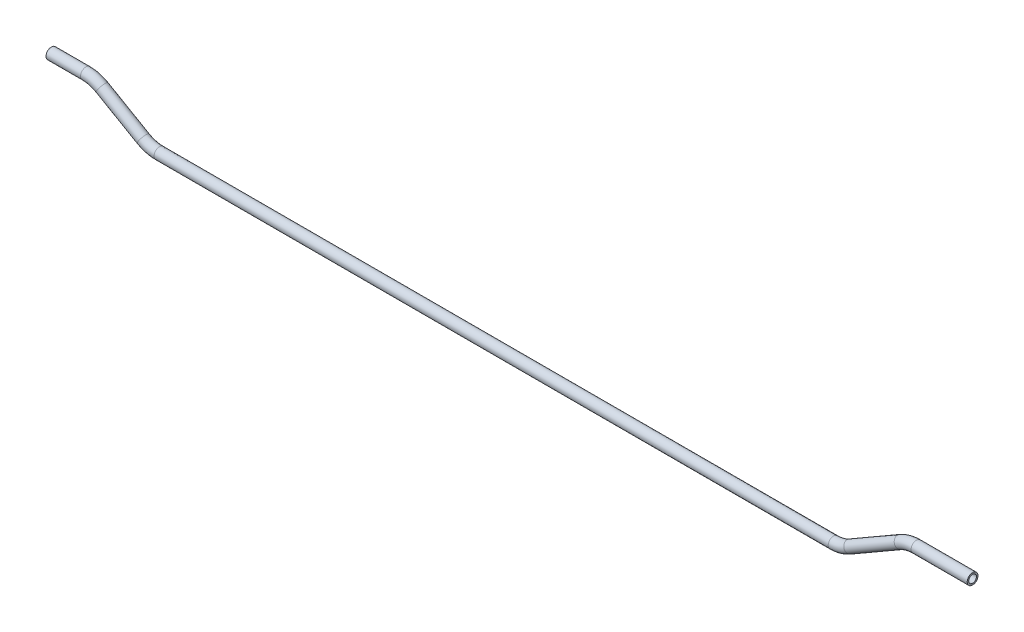
ISO-10303-21;
HEADER;
FILE_DESCRIPTION(('STEP AP214'),'2;1');
FILE_NAME('part.step','',(''),(''),'','','');
FILE_SCHEMA(('AUTOMOTIVE_DESIGN { 1 0 10303 214 1 1 1 1 }'));
ENDSEC;
DATA;
#1=APPLICATION_CONTEXT('core data for automotive mechanical design processes');
#2=APPLICATION_PROTOCOL_DEFINITION('international standard','automotive_design',2000,#1);
#3=PRODUCT_CONTEXT('',#1,'mechanical');
#4=PRODUCT('Part','Part','',(#3));
#5=PRODUCT_RELATED_PRODUCT_CATEGORY('part','',(#4));
#6=PRODUCT_DEFINITION_FORMATION('','',#4);
#7=PRODUCT_DEFINITION_CONTEXT('part definition',#1,'design');
#8=PRODUCT_DEFINITION('design','',#6,#7);
#9=PRODUCT_DEFINITION_SHAPE('','',#8);
#10=(LENGTH_UNIT() NAMED_UNIT(*) SI_UNIT(.MILLI.,.METRE.));
#11=(NAMED_UNIT(*) PLANE_ANGLE_UNIT() SI_UNIT($,.RADIAN.));
#12=(NAMED_UNIT(*) SI_UNIT($,.STERADIAN.) SOLID_ANGLE_UNIT());
#13=UNCERTAINTY_MEASURE_WITH_UNIT(LENGTH_MEASURE(1.E-05),#10,'distance_accuracy_value','');
#14=(GEOMETRIC_REPRESENTATION_CONTEXT(3) GLOBAL_UNCERTAINTY_ASSIGNED_CONTEXT((#13)) GLOBAL_UNIT_ASSIGNED_CONTEXT((#10,
#11,#12)) REPRESENTATION_CONTEXT('',''));
#15=CARTESIAN_POINT('',(0.,0.,0.));
#16=DIRECTION('',(0.,0.,1.));
#17=DIRECTION('',(1.,0.,0.));
#18=AXIS2_PLACEMENT_3D('',#15,#16,#17);
#19=CARTESIAN_POINT('',(-15.2007895417832,-14.7828746599777,0.));
#20=DIRECTION('',(1.,0.,0.));
#21=DIRECTION('',(0.,1.,0.));
#22=AXIS2_PLACEMENT_3D('',#19,#20,#21);
#23=CYLINDRICAL_SURFACE('',#22,3.175);
#24=CARTESIAN_POINT('',(5.0947783424039,-14.7828746599777,0.));
#25=DIRECTION('',(1.,0.,0.));
#26=DIRECTION('',(0.,1.,0.));
#27=AXIS2_PLACEMENT_3D('',#24,#25,#26);
#28=CIRCLE('',#27,3.175);
#29=CARTESIAN_POINT('',(5.0947783424039,-11.6078746599777,0.));
#30=VERTEX_POINT('',#29);
#31=EDGE_CURVE('E54',#30,#30,#28,.T.);
#32=ORIENTED_EDGE('',*,*,#31,.F.);
#33=EDGE_LOOP('',(#32));
#34=FACE_BOUND('',#33,.T.);
#35=CARTESIAN_POINT('',(-15.2007895417832,-14.7828746599777,0.));
#36=DIRECTION('',(1.,0.,0.));
#37=DIRECTION('',(0.,1.,0.));
#38=AXIS2_PLACEMENT_3D('',#35,#36,#37);
#39=CIRCLE('',#38,3.175);
#40=CARTESIAN_POINT('',(-15.2007895417832,-11.6078746599777,0.));
#41=VERTEX_POINT('',#40);
#42=EDGE_CURVE('E51',#41,#41,#39,.T.);
#43=ORIENTED_EDGE('',*,*,#42,.T.);
#44=EDGE_LOOP('',(#43));
#45=FACE_BOUND('',#44,.T.);
#46=ADVANCED_FACE('F30',(#34,#45),#23,.T.);
#47=CARTESIAN_POINT('',(5.0947783424039,-33.8328746599777,0.));
#48=DIRECTION('',(0.,0.,-1.));
#49=DIRECTION('',(-1.,0.,0.));
#50=AXIS2_PLACEMENT_3D('',#47,#48,#49);
#51=TOROIDAL_SURFACE('',#50,19.05,3.175);
#52=CARTESIAN_POINT('',(14.6197783424039,-17.3350907178842,0.));
#53=DIRECTION('',(0.866025403784438,-0.500000000000001,0.));
#54=DIRECTION('',(0.500000000000001,0.866025403784438,0.));
#55=AXIS2_PLACEMENT_3D('',#52,#53,#54);
#56=CIRCLE('',#55,3.175);
#57=CARTESIAN_POINT('',(16.2072783424039,-14.5854600608686,0.));
#58=VERTEX_POINT('',#57);
#59=EDGE_CURVE('E57',#58,#58,#56,.T.);
#60=CARTESIAN_POINT('',(5.0947783424039,-33.8328746599777,0.));
#61=DIRECTION('',(0.,0.,-1.));
#62=DIRECTION('',(-1.,0.,0.));
#63=AXIS2_PLACEMENT_3D('',#60,#61,#62);
#64=CIRCLE('',#63,22.225);
#65=EDGE_CURVE('',#30,#58,#64,.T.);
#66=ORIENTED_EDGE('',*,*,#31,.T.);
#67=ORIENTED_EDGE('',*,*,#59,.F.);
#68=ORIENTED_EDGE('',*,*,#65,.T.);
#69=ORIENTED_EDGE('',*,*,#65,.F.);
#70=EDGE_LOOP('',(#66,#68,#67,#69));
#71=FACE_BOUND('',#70,.T.);
#72=ADVANCED_FACE('F114',(#71),#51,.T.);
#73=CARTESIAN_POINT('',(14.6197783424039,-17.3350907178842,0.));
#74=DIRECTION('',(0.866025403784439,-0.499999999999999,0.));
#75=DIRECTION('',(0.499999999999999,0.866025403784439,0.));
#76=AXIS2_PLACEMENT_3D('',#73,#74,#75);
#77=CYLINDRICAL_SURFACE('',#76,3.175);
#78=CARTESIAN_POINT('',(38.7742104582168,-31.2806586020712,0.));
#79=DIRECTION('',(0.866025403784439,-0.499999999999999,0.));
#80=DIRECTION('',(0.499999999999999,0.866025403784439,0.));
#81=AXIS2_PLACEMENT_3D('',#78,#79,#80);
#82=CIRCLE('',#81,3.175);
#83=CARTESIAN_POINT('',(37.1867104582168,-34.0302892590868,0.));
#84=VERTEX_POINT('',#83);
#85=EDGE_CURVE('E60',#84,#84,#82,.T.);
#86=ORIENTED_EDGE('',*,*,#85,.F.);
#87=EDGE_LOOP('',(#86));
#88=FACE_BOUND('',#87,.T.);
#89=ORIENTED_EDGE('',*,*,#59,.T.);
#90=EDGE_LOOP('',(#89));
#91=FACE_BOUND('',#90,.T.);
#92=ADVANCED_FACE('F118',(#88,#91),#77,.T.);
#93=CARTESIAN_POINT('',(48.2992104582168,-14.7828746599777,0.));
#94=DIRECTION('',(0.,0.,1.));
#95=DIRECTION('',(1.,0.,0.));
#96=AXIS2_PLACEMENT_3D('',#93,#94,#95);
#97=TOROIDAL_SURFACE('',#96,19.05,3.175);
#98=CARTESIAN_POINT('',(48.2992104582168,-33.8328746599777,0.));
#99=DIRECTION('',(1.,0.,0.));
#100=DIRECTION('',(0.,1.,0.));
#101=AXIS2_PLACEMENT_3D('',#98,#99,#100);
#102=CIRCLE('',#101,3.175);
#103=CARTESIAN_POINT('',(48.2992104582168,-37.0078746599777,0.));
#104=VERTEX_POINT('',#103);
#105=EDGE_CURVE('E63',#104,#104,#102,.T.);
#106=CARTESIAN_POINT('',(48.2992104582168,-14.7828746599777,0.));
#107=DIRECTION('',(0.,0.,1.));
#108=DIRECTION('',(1.,0.,0.));
#109=AXIS2_PLACEMENT_3D('',#106,#107,#108);
#110=CIRCLE('',#109,22.225);
#111=EDGE_CURVE('',#84,#104,#110,.T.);
#112=ORIENTED_EDGE('',*,*,#85,.T.);
#113=ORIENTED_EDGE('',*,*,#105,.F.);
#114=ORIENTED_EDGE('',*,*,#111,.T.);
#115=ORIENTED_EDGE('',*,*,#111,.F.);
#116=EDGE_LOOP('',(#112,#114,#113,#115));
#117=FACE_BOUND('',#116,.T.);
#118=ADVANCED_FACE('F122',(#117),#97,.T.);
#119=CARTESIAN_POINT('',(48.2992104582168,-33.8328746599777,0.));
#120=DIRECTION('',(1.,0.,0.));
#121=DIRECTION('',(0.,1.,0.));
#122=AXIS2_PLACEMENT_3D('',#119,#120,#121);
#123=CYLINDRICAL_SURFACE('',#122,3.175);
#124=CARTESIAN_POINT('',(444.490346226591,-33.8328746599776,0.));
#125=DIRECTION('',(1.,0.,0.));
#126=DIRECTION('',(0.,1.,0.));
#127=AXIS2_PLACEMENT_3D('',#124,#125,#126);
#128=CIRCLE('',#127,3.175);
#129=CARTESIAN_POINT('',(444.490346226591,-37.0078746599776,0.));
#130=VERTEX_POINT('',#129);
#131=EDGE_CURVE('E66',#130,#130,#128,.T.);
#132=ORIENTED_EDGE('',*,*,#131,.F.);
#133=EDGE_LOOP('',(#132));
#134=FACE_BOUND('',#133,.T.);
#135=ORIENTED_EDGE('',*,*,#105,.T.);
#136=EDGE_LOOP('',(#135));
#137=FACE_BOUND('',#136,.T.);
#138=ADVANCED_FACE('F126',(#134,#137),#123,.T.);
#139=CARTESIAN_POINT('',(444.490346226591,-14.7828746599776,0.));
#140=DIRECTION('',(0.,0.,1.));
#141=DIRECTION('',(1.,0.,0.));
#142=AXIS2_PLACEMENT_3D('',#139,#140,#141);
#143=TOROIDAL_SURFACE('',#142,19.05,3.175);
#144=CARTESIAN_POINT('',(454.015346226591,-31.2806586020711,0.));
#145=DIRECTION('',(0.866025403784438,0.5,0.));
#146=DIRECTION('',(-0.5,0.866025403784438,0.));
#147=AXIS2_PLACEMENT_3D('',#144,#145,#146);
#148=CIRCLE('',#147,3.175);
#149=CARTESIAN_POINT('',(455.602846226591,-34.0302892590867,0.));
#150=VERTEX_POINT('',#149);
#151=EDGE_CURVE('E69',#150,#150,#148,.T.);
#152=CARTESIAN_POINT('',(444.490346226591,-14.7828746599776,0.));
#153=DIRECTION('',(0.,0.,1.));
#154=DIRECTION('',(1.,0.,0.));
#155=AXIS2_PLACEMENT_3D('',#152,#153,#154);
#156=CIRCLE('',#155,22.225);
#157=EDGE_CURVE('',#130,#150,#156,.T.);
#158=ORIENTED_EDGE('',*,*,#131,.T.);
#159=ORIENTED_EDGE('',*,*,#151,.F.);
#160=ORIENTED_EDGE('',*,*,#157,.T.);
#161=ORIENTED_EDGE('',*,*,#157,.F.);
#162=EDGE_LOOP('',(#158,#160,#159,#161));
#163=FACE_BOUND('',#162,.T.);
#164=ADVANCED_FACE('F88',(#163),#143,.T.);
#165=CARTESIAN_POINT('',(454.015346226591,-31.2806586020711,0.));
#166=DIRECTION('',(0.866025403784438,0.500000000000001,0.));
#167=DIRECTION('',(-0.500000000000001,0.866025403784438,0.));
#168=AXIS2_PLACEMENT_3D('',#165,#166,#167);
#169=CYLINDRICAL_SURFACE('',#168,3.175);
#170=CARTESIAN_POINT('',(483.669039656435,-14.1600907178841,0.));
#171=DIRECTION('',(0.866025403784438,0.500000000000001,0.));
#172=DIRECTION('',(-0.500000000000001,0.866025403784438,0.));
#173=AXIS2_PLACEMENT_3D('',#170,#171,#172);
#174=CIRCLE('',#173,3.175);
#175=CARTESIAN_POINT('',(482.081539656435,-11.4104600608685,0.));
#176=VERTEX_POINT('',#175);
#177=EDGE_CURVE('E71',#176,#176,#174,.T.);
#178=ORIENTED_EDGE('',*,*,#177,.F.);
#179=EDGE_LOOP('',(#178));
#180=FACE_BOUND('',#179,.T.);
#181=ORIENTED_EDGE('',*,*,#151,.T.);
#182=EDGE_LOOP('',(#181));
#183=FACE_BOUND('',#182,.T.);
#184=ADVANCED_FACE('F81',(#180,#183),#169,.T.);
#185=CARTESIAN_POINT('',(493.194039656435,-30.6578746599776,0.));
#186=DIRECTION('',(0.,0.,-1.));
#187=DIRECTION('',(-1.,0.,0.));
#188=AXIS2_PLACEMENT_3D('',#185,#186,#187);
#189=TOROIDAL_SURFACE('',#188,19.05,3.175);
#190=CARTESIAN_POINT('',(493.194039656435,-11.6078746599776,0.));
#191=DIRECTION('',(1.,0.,0.));
#192=DIRECTION('',(0.,1.,0.));
#193=AXIS2_PLACEMENT_3D('',#190,#191,#192);
#194=CIRCLE('',#193,3.175);
#195=CARTESIAN_POINT('',(493.194039656435,-8.43287465997765,0.));
#196=VERTEX_POINT('',#195);
#197=EDGE_CURVE('E34',#196,#196,#194,.T.);
#198=CARTESIAN_POINT('',(493.194039656435,-30.6578746599776,0.));
#199=DIRECTION('',(0.,0.,-1.));
#200=DIRECTION('',(-1.,0.,0.));
#201=AXIS2_PLACEMENT_3D('',#198,#199,#200);
#202=CIRCLE('',#201,22.225);
#203=EDGE_CURVE('',#176,#196,#202,.T.);
#204=ORIENTED_EDGE('',*,*,#177,.T.);
#205=ORIENTED_EDGE('',*,*,#197,.F.);
#206=ORIENTED_EDGE('',*,*,#203,.T.);
#207=ORIENTED_EDGE('',*,*,#203,.F.);
#208=EDGE_LOOP('',(#204,#206,#205,#207));
#209=FACE_BOUND('',#208,.T.);
#210=ADVANCED_FACE('F79',(#209),#189,.T.);
#211=CARTESIAN_POINT('',(493.194039656435,-11.6078746599776,0.));
#212=DIRECTION('',(1.,0.,0.));
#213=DIRECTION('',(0.,1.,0.));
#214=AXIS2_PLACEMENT_3D('',#211,#212,#213);
#215=CYLINDRICAL_SURFACE('',#214,3.175);
#216=CARTESIAN_POINT('',(526.189607540622,-11.6078746599776,0.));
#217=DIRECTION('',(1.,0.,0.));
#218=DIRECTION('',(0.,1.,0.));
#219=AXIS2_PLACEMENT_3D('',#216,#217,#218);
#220=CIRCLE('',#219,3.175);
#221=CARTESIAN_POINT('',(526.189607540622,-8.43287465997762,0.));
#222=VERTEX_POINT('',#221);
#223=EDGE_CURVE('E47',#222,#222,#220,.T.);
#224=ORIENTED_EDGE('',*,*,#223,.F.);
#225=EDGE_LOOP('',(#224));
#226=FACE_BOUND('',#225,.T.);
#227=ORIENTED_EDGE('',*,*,#197,.T.);
#228=EDGE_LOOP('',(#227));
#229=FACE_BOUND('',#228,.T.);
#230=ADVANCED_FACE('F32',(#226,#229),#215,.T.);
#231=CARTESIAN_POINT('',(-15.2007895417832,-14.7828746599777,0.));
#232=DIRECTION('',(1.,0.,0.));
#233=DIRECTION('',(0.,1.,0.));
#234=AXIS2_PLACEMENT_3D('',#231,#232,#233);
#235=PLANE('',#234);
#236=CARTESIAN_POINT('',(-15.2007895417832,-14.7828746599777,0.));
#237=DIRECTION('',(1.,0.,0.));
#238=DIRECTION('',(0.,1.,0.));
#239=AXIS2_PLACEMENT_3D('',#236,#237,#238);
#240=CIRCLE('',#239,2.286);
#241=CARTESIAN_POINT('',(-15.2007895417832,-12.4968746599777,0.));
#242=VERTEX_POINT('',#241);
#243=EDGE_CURVE('E50',#242,#242,#240,.F.);
#244=ORIENTED_EDGE('',*,*,#243,.F.);
#245=EDGE_LOOP('',(#244));
#246=FACE_BOUND('',#245,.T.);
#247=ORIENTED_EDGE('',*,*,#42,.F.);
#248=EDGE_LOOP('',(#247));
#249=FACE_BOUND('',#248,.T.);
#250=ADVANCED_FACE('F86',(#246,#249),#235,.F.);
#251=CARTESIAN_POINT('',(526.189607540622,-11.6078746599776,0.));
#252=DIRECTION('',(1.,0.,0.));
#253=DIRECTION('',(0.,1.,0.));
#254=AXIS2_PLACEMENT_3D('',#251,#252,#253);
#255=PLANE('',#254);
#256=CARTESIAN_POINT('',(526.189607540622,-11.6078746599776,0.));
#257=DIRECTION('',(1.,0.,0.));
#258=DIRECTION('',(0.,1.,0.));
#259=AXIS2_PLACEMENT_3D('',#256,#257,#258);
#260=CIRCLE('',#259,2.286);
#261=CARTESIAN_POINT('',(526.189607540622,-9.32187465997763,0.));
#262=VERTEX_POINT('',#261);
#263=EDGE_CURVE('E10',#262,#262,#260,.F.);
#264=ORIENTED_EDGE('',*,*,#263,.T.);
#265=EDGE_LOOP('',(#264));
#266=FACE_BOUND('',#265,.T.);
#267=ORIENTED_EDGE('',*,*,#223,.T.);
#268=EDGE_LOOP('',(#267));
#269=FACE_BOUND('',#268,.T.);
#270=ADVANCED_FACE('F105',(#266,#269),#255,.T.);
#271=CARTESIAN_POINT('',(-15.2007895417832,-14.7828746599777,0.));
#272=DIRECTION('',(1.,0.,0.));
#273=DIRECTION('',(0.,1.,0.));
#274=AXIS2_PLACEMENT_3D('',#271,#272,#273);
#275=CYLINDRICAL_SURFACE('',#274,2.286);
#276=CARTESIAN_POINT('',(5.0947783424039,-14.7828746599777,0.));
#277=DIRECTION('',(1.,0.,0.));
#278=DIRECTION('',(0.,1.,0.));
#279=AXIS2_PLACEMENT_3D('',#276,#277,#278);
#280=CIRCLE('',#279,2.286);
#281=CARTESIAN_POINT('',(5.0947783424039,-12.4968746599777,0.));
#282=VERTEX_POINT('',#281);
#283=EDGE_CURVE('E279',#282,#282,#280,.F.);
#284=ORIENTED_EDGE('',*,*,#283,.F.);
#285=EDGE_LOOP('',(#284));
#286=FACE_BOUND('',#285,.T.);
#287=ORIENTED_EDGE('',*,*,#243,.T.);
#288=EDGE_LOOP('',(#287));
#289=FACE_BOUND('',#288,.T.);
#290=ADVANCED_FACE('F108',(#286,#289),#275,.F.);
#291=CARTESIAN_POINT('',(5.0947783424039,-33.8328746599777,0.));
#292=DIRECTION('',(0.,0.,-1.));
#293=DIRECTION('',(-1.,0.,0.));
#294=AXIS2_PLACEMENT_3D('',#291,#292,#293);
#295=TOROIDAL_SURFACE('',#294,19.05,2.286);
#296=CARTESIAN_POINT('',(14.6197783424039,-17.3350907178842,0.));
#297=DIRECTION('',(0.866025403784438,-0.500000000000001,0.));
#298=DIRECTION('',(0.500000000000001,0.866025403784438,0.));
#299=AXIS2_PLACEMENT_3D('',#296,#297,#298);
#300=CIRCLE('',#299,2.286);
#301=CARTESIAN_POINT('',(15.7627783424039,-15.3553566448329,0.));
#302=VERTEX_POINT('',#301);
#303=EDGE_CURVE('E276',#302,#302,#300,.F.);
#304=CARTESIAN_POINT('',(5.0947783424039,-33.8328746599777,0.));
#305=DIRECTION('',(0.,0.,-1.));
#306=DIRECTION('',(-1.,0.,0.));
#307=AXIS2_PLACEMENT_3D('',#304,#305,#306);
#308=CIRCLE('',#307,21.336);
#309=EDGE_CURVE('',#282,#302,#308,.T.);
#310=ORIENTED_EDGE('',*,*,#283,.T.);
#311=ORIENTED_EDGE('',*,*,#303,.F.);
#312=ORIENTED_EDGE('',*,*,#309,.T.);
#313=ORIENTED_EDGE('',*,*,#309,.F.);
#314=EDGE_LOOP('',(#310,#312,#311,#313));
#315=FACE_BOUND('',#314,.T.);
#316=ADVANCED_FACE('F187',(#315),#295,.F.);
#317=CARTESIAN_POINT('',(14.6197783424039,-17.3350907178842,0.));
#318=DIRECTION('',(0.866025403784439,-0.499999999999999,0.));
#319=DIRECTION('',(0.499999999999999,0.866025403784439,0.));
#320=AXIS2_PLACEMENT_3D('',#317,#318,#319);
#321=CYLINDRICAL_SURFACE('',#320,2.286);
#322=CARTESIAN_POINT('',(38.7742104582168,-31.2806586020712,0.));
#323=DIRECTION('',(0.866025403784439,-0.499999999999999,0.));
#324=DIRECTION('',(0.499999999999999,0.866025403784439,0.));
#325=AXIS2_PLACEMENT_3D('',#322,#323,#324);
#326=CIRCLE('',#325,2.286);
#327=CARTESIAN_POINT('',(37.6312104582168,-33.2603926751225,0.));
#328=VERTEX_POINT('',#327);
#329=EDGE_CURVE('E273',#328,#328,#326,.F.);
#330=ORIENTED_EDGE('',*,*,#329,.F.);
#331=EDGE_LOOP('',(#330));
#332=FACE_BOUND('',#331,.T.);
#333=ORIENTED_EDGE('',*,*,#303,.T.);
#334=EDGE_LOOP('',(#333));
#335=FACE_BOUND('',#334,.T.);
#336=ADVANCED_FACE('F197',(#332,#335),#321,.F.);
#337=CARTESIAN_POINT('',(48.2992104582168,-14.7828746599777,0.));
#338=DIRECTION('',(0.,0.,1.));
#339=DIRECTION('',(1.,0.,0.));
#340=AXIS2_PLACEMENT_3D('',#337,#338,#339);
#341=TOROIDAL_SURFACE('',#340,19.05,2.286);
#342=CARTESIAN_POINT('',(48.2992104582168,-33.8328746599777,0.));
#343=DIRECTION('',(1.,0.,0.));
#344=DIRECTION('',(0.,1.,0.));
#345=AXIS2_PLACEMENT_3D('',#342,#343,#344);
#346=CIRCLE('',#345,2.286);
#347=CARTESIAN_POINT('',(48.2992104582168,-36.1188746599777,0.));
#348=VERTEX_POINT('',#347);
#349=EDGE_CURVE('E268',#348,#348,#346,.F.);
#350=CARTESIAN_POINT('',(48.2992104582168,-14.7828746599777,0.));
#351=DIRECTION('',(0.,0.,1.));
#352=DIRECTION('',(1.,0.,0.));
#353=AXIS2_PLACEMENT_3D('',#350,#351,#352);
#354=CIRCLE('',#353,21.336);
#355=EDGE_CURVE('',#328,#348,#354,.T.);
#356=ORIENTED_EDGE('',*,*,#329,.T.);
#357=ORIENTED_EDGE('',*,*,#349,.F.);
#358=ORIENTED_EDGE('',*,*,#355,.T.);
#359=ORIENTED_EDGE('',*,*,#355,.F.);
#360=EDGE_LOOP('',(#356,#358,#357,#359));
#361=FACE_BOUND('',#360,.T.);
#362=ADVANCED_FACE('F207',(#361),#341,.F.);
#363=CARTESIAN_POINT('',(48.2992104582168,-33.8328746599777,0.));
#364=DIRECTION('',(1.,0.,0.));
#365=DIRECTION('',(0.,1.,0.));
#366=AXIS2_PLACEMENT_3D('',#363,#364,#365);
#367=CYLINDRICAL_SURFACE('',#366,2.286);
#368=CARTESIAN_POINT('',(444.490346226591,-33.8328746599776,0.));
#369=DIRECTION('',(1.,0.,0.));
#370=DIRECTION('',(0.,1.,0.));
#371=AXIS2_PLACEMENT_3D('',#368,#369,#370);
#372=CIRCLE('',#371,2.286);
#373=CARTESIAN_POINT('',(444.490346226591,-36.1188746599776,0.));
#374=VERTEX_POINT('',#373);
#375=EDGE_CURVE('E265',#374,#374,#372,.F.);
#376=ORIENTED_EDGE('',*,*,#375,.F.);
#377=EDGE_LOOP('',(#376));
#378=FACE_BOUND('',#377,.T.);
#379=ORIENTED_EDGE('',*,*,#349,.T.);
#380=EDGE_LOOP('',(#379));
#381=FACE_BOUND('',#380,.T.);
#382=ADVANCED_FACE('F217',(#378,#381),#367,.F.);
#383=CARTESIAN_POINT('',(444.490346226591,-14.7828746599776,0.));
#384=DIRECTION('',(0.,0.,1.));
#385=DIRECTION('',(1.,0.,0.));
#386=AXIS2_PLACEMENT_3D('',#383,#384,#385);
#387=TOROIDAL_SURFACE('',#386,19.05,2.286);
#388=CARTESIAN_POINT('',(454.015346226591,-31.2806586020711,0.));
#389=DIRECTION('',(0.866025403784438,0.5,0.));
#390=DIRECTION('',(-0.5,0.866025403784438,0.));
#391=AXIS2_PLACEMENT_3D('',#388,#389,#390);
#392=CIRCLE('',#391,2.286);
#393=CARTESIAN_POINT('',(455.158346226591,-33.2603926751223,0.));
#394=VERTEX_POINT('',#393);
#395=EDGE_CURVE('E264',#394,#394,#392,.F.);
#396=CARTESIAN_POINT('',(444.490346226591,-14.7828746599776,0.));
#397=DIRECTION('',(0.,0.,1.));
#398=DIRECTION('',(1.,0.,0.));
#399=AXIS2_PLACEMENT_3D('',#396,#397,#398);
#400=CIRCLE('',#399,21.336);
#401=EDGE_CURVE('',#374,#394,#400,.T.);
#402=ORIENTED_EDGE('',*,*,#375,.T.);
#403=ORIENTED_EDGE('',*,*,#395,.F.);
#404=ORIENTED_EDGE('',*,*,#401,.T.);
#405=ORIENTED_EDGE('',*,*,#401,.F.);
#406=EDGE_LOOP('',(#402,#404,#403,#405));
#407=FACE_BOUND('',#406,.T.);
#408=ADVANCED_FACE('F227',(#407),#387,.F.);
#409=CARTESIAN_POINT('',(454.015346226591,-31.2806586020711,0.));
#410=DIRECTION('',(0.866025403784438,0.500000000000001,0.));
#411=DIRECTION('',(-0.500000000000001,0.866025403784438,0.));
#412=AXIS2_PLACEMENT_3D('',#409,#410,#411);
#413=CYLINDRICAL_SURFACE('',#412,2.286);
#414=CARTESIAN_POINT('',(483.669039656435,-14.1600907178841,0.));
#415=DIRECTION('',(0.866025403784438,0.500000000000001,0.));
#416=DIRECTION('',(-0.500000000000001,0.866025403784438,0.));
#417=AXIS2_PLACEMENT_3D('',#414,#415,#416);
#418=CIRCLE('',#417,2.286);
#419=CARTESIAN_POINT('',(482.526039656435,-12.1803566448329,0.));
#420=VERTEX_POINT('',#419);
#421=EDGE_CURVE('E43',#420,#420,#418,.F.);
#422=ORIENTED_EDGE('',*,*,#421,.F.);
#423=EDGE_LOOP('',(#422));
#424=FACE_BOUND('',#423,.T.);
#425=ORIENTED_EDGE('',*,*,#395,.T.);
#426=EDGE_LOOP('',(#425));
#427=FACE_BOUND('',#426,.T.);
#428=ADVANCED_FACE('F99',(#424,#427),#413,.F.);
#429=CARTESIAN_POINT('',(493.194039656435,-30.6578746599776,0.));
#430=DIRECTION('',(0.,0.,-1.));
#431=DIRECTION('',(-1.,0.,0.));
#432=AXIS2_PLACEMENT_3D('',#429,#430,#431);
#433=TOROIDAL_SURFACE('',#432,19.05,2.286);
#434=CARTESIAN_POINT('',(493.194039656435,-11.6078746599776,0.));
#435=DIRECTION('',(1.,0.,0.));
#436=DIRECTION('',(0.,1.,0.));
#437=AXIS2_PLACEMENT_3D('',#434,#435,#436);
#438=CIRCLE('',#437,2.286);
#439=CARTESIAN_POINT('',(493.194039656435,-9.32187465997765,0.));
#440=VERTEX_POINT('',#439);
#441=EDGE_CURVE('E38',#440,#440,#438,.F.);
#442=CARTESIAN_POINT('',(493.194039656435,-30.6578746599776,0.));
#443=DIRECTION('',(0.,0.,-1.));
#444=DIRECTION('',(-1.,0.,0.));
#445=AXIS2_PLACEMENT_3D('',#442,#443,#444);
#446=CIRCLE('',#445,21.336);
#447=EDGE_CURVE('',#420,#440,#446,.T.);
#448=ORIENTED_EDGE('',*,*,#421,.T.);
#449=ORIENTED_EDGE('',*,*,#441,.F.);
#450=ORIENTED_EDGE('',*,*,#447,.T.);
#451=ORIENTED_EDGE('',*,*,#447,.F.);
#452=EDGE_LOOP('',(#448,#450,#449,#451));
#453=FACE_BOUND('',#452,.T.);
#454=ADVANCED_FACE('F93',(#453),#433,.F.);
#455=CARTESIAN_POINT('',(493.194039656435,-11.6078746599776,0.));
#456=DIRECTION('',(1.,0.,0.));
#457=DIRECTION('',(0.,1.,0.));
#458=AXIS2_PLACEMENT_3D('',#455,#456,#457);
#459=CYLINDRICAL_SURFACE('',#458,2.286);
#460=ORIENTED_EDGE('',*,*,#263,.F.);
#461=EDGE_LOOP('',(#460));
#462=FACE_BOUND('',#461,.T.);
#463=ORIENTED_EDGE('',*,*,#441,.T.);
#464=EDGE_LOOP('',(#463));
#465=FACE_BOUND('',#464,.T.);
#466=ADVANCED_FACE('F91',(#462,#465),#459,.F.);
#467=CLOSED_SHELL('',(#46,#72,#92,#118,#138,#164,#184,#210,#230,#250,#270,#290,#316,#336,#362,
#382,#408,#428,#454,#466));
#468=MANIFOLD_SOLID_BREP('B2',#467);
#469=ADVANCED_BREP_SHAPE_REPRESENTATION('',(#18,#468),#14);
#470=SHAPE_DEFINITION_REPRESENTATION(#9,#469);
ENDSEC;
END-ISO-10303-21;
